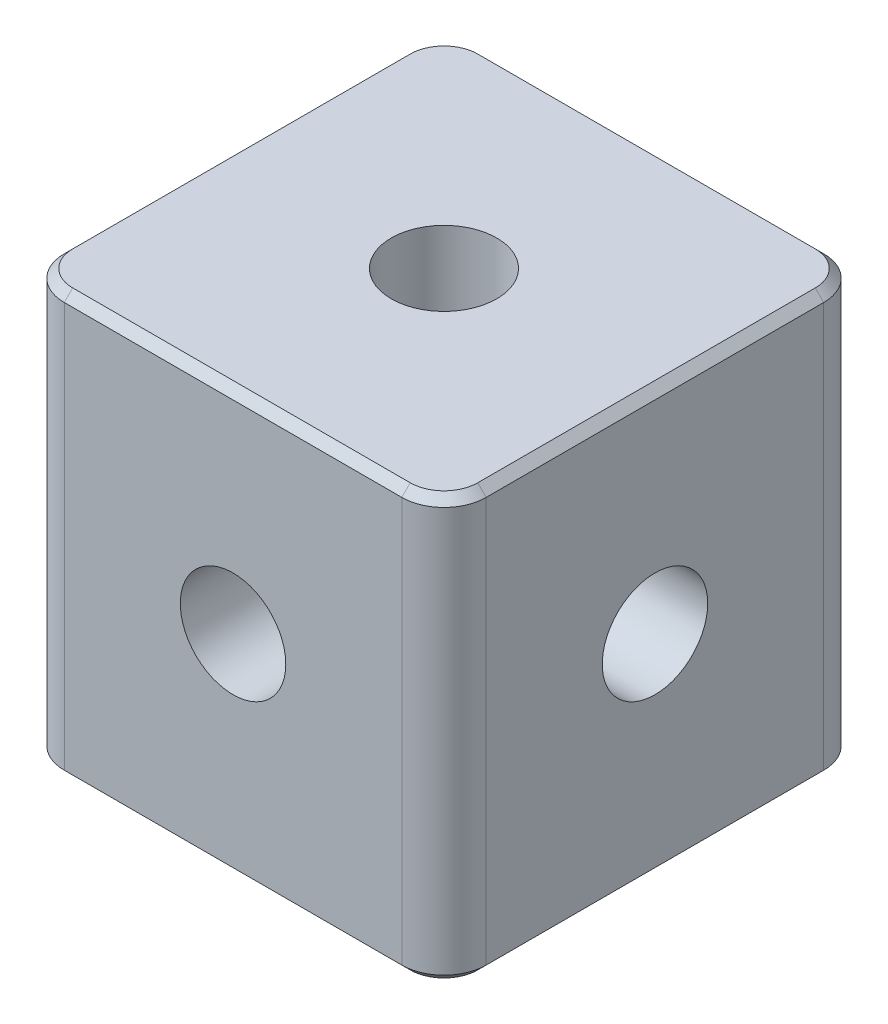
ISO-10303-21;
HEADER;
FILE_DESCRIPTION(('STEP AP214'),'2;1');
FILE_NAME('part.step','',(''),(''),'','','');
FILE_SCHEMA(('AUTOMOTIVE_DESIGN { 1 0 10303 214 1 1 1 1 }'));
ENDSEC;
DATA;
#1=APPLICATION_CONTEXT('core data for automotive mechanical design processes');
#2=APPLICATION_PROTOCOL_DEFINITION('international standard','automotive_design',2000,#1);
#3=PRODUCT_CONTEXT('',#1,'mechanical');
#4=PRODUCT('Part','Part','',(#3));
#5=PRODUCT_RELATED_PRODUCT_CATEGORY('part','',(#4));
#6=PRODUCT_DEFINITION_FORMATION('','',#4);
#7=PRODUCT_DEFINITION_CONTEXT('part definition',#1,'design');
#8=PRODUCT_DEFINITION('design','',#6,#7);
#9=PRODUCT_DEFINITION_SHAPE('','',#8);
#10=(LENGTH_UNIT() NAMED_UNIT(*) SI_UNIT(.MILLI.,.METRE.));
#11=(NAMED_UNIT(*) PLANE_ANGLE_UNIT() SI_UNIT($,.RADIAN.));
#12=(NAMED_UNIT(*) SI_UNIT($,.STERADIAN.) SOLID_ANGLE_UNIT());
#13=UNCERTAINTY_MEASURE_WITH_UNIT(LENGTH_MEASURE(1.E-05),#10,'distance_accuracy_value','');
#14=(GEOMETRIC_REPRESENTATION_CONTEXT(3) GLOBAL_UNCERTAINTY_ASSIGNED_CONTEXT((#13)) GLOBAL_UNIT_ASSIGNED_CONTEXT((#10,
#11,#12)) REPRESENTATION_CONTEXT('',''));
#15=CARTESIAN_POINT('',(0.,0.,0.));
#16=DIRECTION('',(0.,0.,1.));
#17=DIRECTION('',(1.,0.,0.));
#18=AXIS2_PLACEMENT_3D('',#15,#16,#17);
#19=CARTESIAN_POINT('',(0.,5.,0.));
#20=DIRECTION('',(0.,1.,0.));
#21=DIRECTION('',(0.,0.,1.));
#22=AXIS2_PLACEMENT_3D('',#19,#20,#21);
#23=CYLINDRICAL_SURFACE('',#22,1.25);
#24=CARTESIAN_POINT('',(0.,5.,0.));
#25=DIRECTION('',(0.,1.,0.));
#26=DIRECTION('',(0.,0.,1.));
#27=AXIS2_PLACEMENT_3D('',#24,#25,#26);
#28=CIRCLE('',#27,1.25);
#29=CARTESIAN_POINT('',(0.,5.,1.25));
#30=VERTEX_POINT('',#29);
#31=EDGE_CURVE('E418',#30,#30,#28,.T.);
#32=ORIENTED_EDGE('',*,*,#31,.T.);
#33=EDGE_LOOP('',(#32));
#34=FACE_BOUND('',#33,.T.);
#35=CARTESIAN_POINT('',(0.,0.,0.));
#36=DIRECTION('',(0.,0.707106781186547,-0.707106781186547));
#37=DIRECTION('',(0.,0.707106781186547,0.707106781186547));
#38=AXIS2_PLACEMENT_3D('',#35,#36,#37);
#39=ELLIPSE('',#38,1.76776695296636,1.25);
#40=CARTESIAN_POINT('',(0.883883476483181,0.883883476483181,0.883883476483181));
#41=VERTEX_POINT('',#40);
#42=CARTESIAN_POINT('',(-0.883883476483181,0.883883476483181,0.883883476483181));
#43=VERTEX_POINT('',#42);
#44=EDGE_CURVE('E195',#41,#43,#39,.F.);
#45=ORIENTED_EDGE('',*,*,#44,.T.);
#46=CARTESIAN_POINT('',(0.,0.,0.));
#47=DIRECTION('',(0.707106781186547,0.707106781186547,0.));
#48=DIRECTION('',(-0.707106781186547,0.707106781186547,0.));
#49=AXIS2_PLACEMENT_3D('',#46,#47,#48);
#50=ELLIPSE('',#49,1.76776695296636,1.25);
#51=CARTESIAN_POINT('',(-0.88388347648318,0.88388347648318,-0.88388347648318));
#52=VERTEX_POINT('',#51);
#53=EDGE_CURVE('E179',#43,#52,#50,.F.);
#54=ORIENTED_EDGE('',*,*,#53,.T.);
#55=CARTESIAN_POINT('',(0.,0.,0.));
#56=DIRECTION('',(0.,0.707106781186547,0.707106781186547));
#57=DIRECTION('',(0.,0.707106781186547,-0.707106781186547));
#58=AXIS2_PLACEMENT_3D('',#55,#56,#57);
#59=ELLIPSE('',#58,1.76776695296636,1.25);
#60=CARTESIAN_POINT('',(0.883883476483181,0.883883476483181,-0.883883476483181));
#61=VERTEX_POINT('',#60);
#62=EDGE_CURVE('E188',#52,#61,#59,.F.);
#63=ORIENTED_EDGE('',*,*,#62,.T.);
#64=CARTESIAN_POINT('',(0.,0.,0.));
#65=DIRECTION('',(-0.707106781186547,0.707106781186547,0.));
#66=DIRECTION('',(0.707106781186547,0.707106781186547,0.));
#67=AXIS2_PLACEMENT_3D('',#64,#65,#66);
#68=ELLIPSE('',#67,1.76776695296636,1.25);
#69=EDGE_CURVE('E439',#61,#41,#68,.F.);
#70=ORIENTED_EDGE('',*,*,#69,.T.);
#71=EDGE_LOOP('',(#45,#54,#63,#70));
#72=FACE_BOUND('',#71,.T.);
#73=ADVANCED_FACE('F36',(#34,#72),#23,.F.);
#74=CARTESIAN_POINT('',(5.,5.,5.));
#75=DIRECTION('',(-1.,0.,0.));
#76=DIRECTION('',(0.,0.,1.));
#77=AXIS2_PLACEMENT_3D('',#74,#75,#76);
#78=PLANE('',#77);
#79=CARTESIAN_POINT('',(5.,0.,0.));
#80=DIRECTION('',(1.,0.,0.));
#81=DIRECTION('',(0.,0.,-1.));
#82=AXIS2_PLACEMENT_3D('',#79,#80,#81);
#83=CIRCLE('',#82,1.24999999999999);
#84=CARTESIAN_POINT('',(5.,0.,-1.24999999999999));
#85=VERTEX_POINT('',#84);
#86=EDGE_CURVE('E317',#85,#85,#83,.T.);
#87=ORIENTED_EDGE('',*,*,#86,.F.);
#88=EDGE_LOOP('',(#87));
#89=FACE_BOUND('',#88,.T.);
#90=DIRECTION('',(0.,-1.,0.));
#91=VECTOR('',#90,1.);
#92=CARTESIAN_POINT('',(5.,5.,4.));
#93=LINE('',#92,#91);
#94=CARTESIAN_POINT('',(5.,4.8,4.));
#95=VERTEX_POINT('',#94);
#96=CARTESIAN_POINT('',(5.,-4.8,4.));
#97=VERTEX_POINT('',#96);
#98=EDGE_CURVE('E214',#95,#97,#93,.T.);
#99=ORIENTED_EDGE('',*,*,#98,.T.);
#100=DIRECTION('',(0.,0.,-1.));
#101=VECTOR('',#100,1.);
#102=CARTESIAN_POINT('',(5.,-4.8,-4.));
#103=LINE('',#102,#101);
#104=CARTESIAN_POINT('',(5.,-4.8,-4.));
#105=VERTEX_POINT('',#104);
#106=EDGE_CURVE('E235',#97,#105,#103,.T.);
#107=ORIENTED_EDGE('',*,*,#106,.T.);
#108=DIRECTION('',(0.,-1.,0.));
#109=VECTOR('',#108,1.);
#110=CARTESIAN_POINT('',(5.,5.,-4.));
#111=LINE('',#110,#109);
#112=CARTESIAN_POINT('',(5.,4.8,-4.));
#113=VERTEX_POINT('',#112);
#114=EDGE_CURVE('E217',#105,#113,#111,.F.);
#115=ORIENTED_EDGE('',*,*,#114,.T.);
#116=DIRECTION('',(0.,0.,1.));
#117=VECTOR('',#116,1.);
#118=CARTESIAN_POINT('',(5.,4.8,5.));
#119=LINE('',#118,#117);
#120=EDGE_CURVE('E232',#113,#95,#119,.T.);
#121=ORIENTED_EDGE('',*,*,#120,.T.);
#122=EDGE_LOOP('',(#99,#107,#115,#121));
#123=FACE_BOUND('',#122,.T.);
#124=ADVANCED_FACE('F403',(#89,#123),#78,.F.);
#125=CARTESIAN_POINT('',(-5.,5.,-5.));
#126=DIRECTION('',(0.,0.,1.));
#127=DIRECTION('',(1.,0.,0.));
#128=AXIS2_PLACEMENT_3D('',#125,#126,#127);
#129=PLANE('',#128);
#130=CARTESIAN_POINT('',(0.,0.,-5.));
#131=DIRECTION('',(0.,0.,1.));
#132=DIRECTION('',(1.,0.,0.));
#133=AXIS2_PLACEMENT_3D('',#130,#131,#132);
#134=CIRCLE('',#133,1.25);
#135=CARTESIAN_POINT('',(1.25,0.,-5.));
#136=VERTEX_POINT('',#135);
#137=EDGE_CURVE('E421',#136,#136,#134,.T.);
#138=ORIENTED_EDGE('',*,*,#137,.T.);
#139=EDGE_LOOP('',(#138));
#140=FACE_BOUND('',#139,.T.);
#141=DIRECTION('',(0.,-1.,0.));
#142=VECTOR('',#141,1.);
#143=CARTESIAN_POINT('',(4.,5.,-5.));
#144=LINE('',#143,#142);
#145=CARTESIAN_POINT('',(4.,4.8,-5.));
#146=VERTEX_POINT('',#145);
#147=CARTESIAN_POINT('',(4.,-4.8,-5.));
#148=VERTEX_POINT('',#147);
#149=EDGE_CURVE('E211',#146,#148,#144,.T.);
#150=ORIENTED_EDGE('',*,*,#149,.T.);
#151=DIRECTION('',(-1.,0.,0.));
#152=VECTOR('',#151,1.);
#153=CARTESIAN_POINT('',(-4.,-4.8,-5.));
#154=LINE('',#153,#152);
#155=CARTESIAN_POINT('',(-4.,-4.8,-5.));
#156=VERTEX_POINT('',#155);
#157=EDGE_CURVE('E265',#148,#156,#154,.T.);
#158=ORIENTED_EDGE('',*,*,#157,.T.);
#159=DIRECTION('',(0.,-1.,0.));
#160=VECTOR('',#159,1.);
#161=CARTESIAN_POINT('',(-4.,5.,-5.));
#162=LINE('',#161,#160);
#163=CARTESIAN_POINT('',(-4.,4.8,-5.));
#164=VERTEX_POINT('',#163);
#165=EDGE_CURVE('E208',#156,#164,#162,.F.);
#166=ORIENTED_EDGE('',*,*,#165,.T.);
#167=DIRECTION('',(1.,0.,0.));
#168=VECTOR('',#167,1.);
#169=CARTESIAN_POINT('',(-5.,4.8,-5.));
#170=LINE('',#169,#168);
#171=EDGE_CURVE('E263',#164,#146,#170,.T.);
#172=ORIENTED_EDGE('',*,*,#171,.T.);
#173=EDGE_LOOP('',(#150,#158,#166,#172));
#174=FACE_BOUND('',#173,.T.);
#175=ADVANCED_FACE('F455',(#140,#174),#129,.F.);
#176=CARTESIAN_POINT('',(-5.,5.,5.));
#177=DIRECTION('',(1.,0.,0.));
#178=DIRECTION('',(0.,0.,-1.));
#179=AXIS2_PLACEMENT_3D('',#176,#177,#178);
#180=PLANE('',#179);
#181=CARTESIAN_POINT('',(-5.,0.,0.));
#182=DIRECTION('',(1.,0.,0.));
#183=DIRECTION('',(0.,0.,-1.));
#184=AXIS2_PLACEMENT_3D('',#181,#182,#183);
#185=CIRCLE('',#184,1.25);
#186=CARTESIAN_POINT('',(-5.,0.,-1.25));
#187=VERTEX_POINT('',#186);
#188=EDGE_CURVE('E743',#187,#187,#185,.T.);
#189=ORIENTED_EDGE('',*,*,#188,.T.);
#190=EDGE_LOOP('',(#189));
#191=FACE_BOUND('',#190,.T.);
#192=DIRECTION('',(0.,-1.,0.));
#193=VECTOR('',#192,1.);
#194=CARTESIAN_POINT('',(-5.,5.,-4.));
#195=LINE('',#194,#193);
#196=CARTESIAN_POINT('',(-5.,4.8,-4.));
#197=VERTEX_POINT('',#196);
#198=CARTESIAN_POINT('',(-5.,-4.8,-4.));
#199=VERTEX_POINT('',#198);
#200=EDGE_CURVE('E226',#197,#199,#195,.T.);
#201=ORIENTED_EDGE('',*,*,#200,.T.);
#202=DIRECTION('',(0.,0.,1.));
#203=VECTOR('',#202,1.);
#204=CARTESIAN_POINT('',(-5.,-4.8,4.));
#205=LINE('',#204,#203);
#206=CARTESIAN_POINT('',(-5.,-4.8,4.));
#207=VERTEX_POINT('',#206);
#208=EDGE_CURVE('E281',#199,#207,#205,.T.);
#209=ORIENTED_EDGE('',*,*,#208,.T.);
#210=DIRECTION('',(0.,-1.,0.));
#211=VECTOR('',#210,1.);
#212=CARTESIAN_POINT('',(-5.,5.,4.));
#213=LINE('',#212,#211);
#214=CARTESIAN_POINT('',(-5.,4.8,4.));
#215=VERTEX_POINT('',#214);
#216=EDGE_CURVE('E229',#207,#215,#213,.F.);
#217=ORIENTED_EDGE('',*,*,#216,.T.);
#218=DIRECTION('',(0.,0.,-1.));
#219=VECTOR('',#218,1.);
#220=CARTESIAN_POINT('',(-5.,4.8,5.));
#221=LINE('',#220,#219);
#222=EDGE_CURVE('E279',#215,#197,#221,.T.);
#223=ORIENTED_EDGE('',*,*,#222,.T.);
#224=EDGE_LOOP('',(#201,#209,#217,#223));
#225=FACE_BOUND('',#224,.T.);
#226=ADVANCED_FACE('F350',(#191,#225),#180,.F.);
#227=CARTESIAN_POINT('',(-5.,5.,5.));
#228=DIRECTION('',(0.,0.,-1.));
#229=DIRECTION('',(-1.,0.,0.));
#230=AXIS2_PLACEMENT_3D('',#227,#228,#229);
#231=PLANE('',#230);
#232=CARTESIAN_POINT('',(0.,0.,5.));
#233=DIRECTION('',(0.,0.,1.));
#234=DIRECTION('',(1.,0.,0.));
#235=AXIS2_PLACEMENT_3D('',#232,#233,#234);
#236=CIRCLE('',#235,1.24999999999999);
#237=CARTESIAN_POINT('',(1.24999999999999,0.,5.));
#238=VERTEX_POINT('',#237);
#239=EDGE_CURVE('E426',#238,#238,#236,.T.);
#240=ORIENTED_EDGE('',*,*,#239,.F.);
#241=EDGE_LOOP('',(#240));
#242=FACE_BOUND('',#241,.T.);
#243=DIRECTION('',(0.,-1.,0.));
#244=VECTOR('',#243,1.);
#245=CARTESIAN_POINT('',(-4.,5.,5.));
#246=LINE('',#245,#244);
#247=CARTESIAN_POINT('',(-4.,4.8,5.));
#248=VERTEX_POINT('',#247);
#249=CARTESIAN_POINT('',(-4.,-4.8,5.));
#250=VERTEX_POINT('',#249);
#251=EDGE_CURVE('E220',#248,#250,#246,.T.);
#252=ORIENTED_EDGE('',*,*,#251,.T.);
#253=DIRECTION('',(1.,0.,0.));
#254=VECTOR('',#253,1.);
#255=CARTESIAN_POINT('',(4.,-4.8,5.));
#256=LINE('',#255,#254);
#257=CARTESIAN_POINT('',(4.,-4.8,5.));
#258=VERTEX_POINT('',#257);
#259=EDGE_CURVE('E269',#250,#258,#256,.T.);
#260=ORIENTED_EDGE('',*,*,#259,.T.);
#261=DIRECTION('',(0.,-1.,0.));
#262=VECTOR('',#261,1.);
#263=CARTESIAN_POINT('',(4.,5.,5.));
#264=LINE('',#263,#262);
#265=CARTESIAN_POINT('',(4.,4.8,5.));
#266=VERTEX_POINT('',#265);
#267=EDGE_CURVE('E223',#258,#266,#264,.F.);
#268=ORIENTED_EDGE('',*,*,#267,.T.);
#269=DIRECTION('',(-1.,0.,0.));
#270=VECTOR('',#269,1.);
#271=CARTESIAN_POINT('',(-5.,4.8,5.));
#272=LINE('',#271,#270);
#273=EDGE_CURVE('E267',#266,#248,#272,.T.);
#274=ORIENTED_EDGE('',*,*,#273,.T.);
#275=EDGE_LOOP('',(#252,#260,#268,#274));
#276=FACE_BOUND('',#275,.T.);
#277=ADVANCED_FACE('F383',(#242,#276),#231,.F.);
#278=CARTESIAN_POINT('',(0.,5.,0.));
#279=DIRECTION('',(0.,-1.,0.));
#280=DIRECTION('',(0.,0.,-1.));
#281=AXIS2_PLACEMENT_3D('',#278,#279,#280);
#282=PLANE('',#281);
#283=CARTESIAN_POINT('',(4.,5.,4.));
#284=DIRECTION('',(0.,-1.,0.));
#285=DIRECTION('',(0.,0.,-1.));
#286=AXIS2_PLACEMENT_3D('',#283,#284,#285);
#287=CIRCLE('',#286,0.800000000000001);
#288=CARTESIAN_POINT('',(4.,5.,4.8));
#289=VERTEX_POINT('',#288);
#290=CARTESIAN_POINT('',(4.8,5.,4.));
#291=VERTEX_POINT('',#290);
#292=EDGE_CURVE('E60',#289,#291,#287,.F.);
#293=ORIENTED_EDGE('',*,*,#292,.T.);
#294=DIRECTION('',(0.,0.,-1.));
#295=VECTOR('',#294,1.);
#296=CARTESIAN_POINT('',(4.8,5.,0.));
#297=LINE('',#296,#295);
#298=CARTESIAN_POINT('',(4.8,5.,-4.));
#299=VERTEX_POINT('',#298);
#300=EDGE_CURVE('E11',#291,#299,#297,.T.);
#301=ORIENTED_EDGE('',*,*,#300,.T.);
#302=CARTESIAN_POINT('',(4.,5.,-4.));
#303=DIRECTION('',(0.,-1.,0.));
#304=DIRECTION('',(0.,0.,-1.));
#305=AXIS2_PLACEMENT_3D('',#302,#303,#304);
#306=CIRCLE('',#305,0.800000000000001);
#307=CARTESIAN_POINT('',(4.,5.,-4.8));
#308=VERTEX_POINT('',#307);
#309=EDGE_CURVE('E45',#299,#308,#306,.F.);
#310=ORIENTED_EDGE('',*,*,#309,.T.);
#311=DIRECTION('',(-1.,0.,0.));
#312=VECTOR('',#311,1.);
#313=CARTESIAN_POINT('',(0.,5.,-4.8));
#314=LINE('',#313,#312);
#315=CARTESIAN_POINT('',(-4.,5.,-4.8));
#316=VERTEX_POINT('',#315);
#317=EDGE_CURVE('E291',#308,#316,#314,.T.);
#318=ORIENTED_EDGE('',*,*,#317,.T.);
#319=CARTESIAN_POINT('',(-4.,5.,-4.));
#320=DIRECTION('',(0.,-1.,0.));
#321=DIRECTION('',(0.,0.,-1.));
#322=AXIS2_PLACEMENT_3D('',#319,#320,#321);
#323=CIRCLE('',#322,0.800000000000001);
#324=CARTESIAN_POINT('',(-4.8,5.,-4.));
#325=VERTEX_POINT('',#324);
#326=EDGE_CURVE('E287',#316,#325,#323,.F.);
#327=ORIENTED_EDGE('',*,*,#326,.T.);
#328=DIRECTION('',(0.,0.,1.));
#329=VECTOR('',#328,1.);
#330=CARTESIAN_POINT('',(-4.8,5.,0.));
#331=LINE('',#330,#329);
#332=CARTESIAN_POINT('',(-4.8,5.,4.));
#333=VERTEX_POINT('',#332);
#334=EDGE_CURVE('E283',#325,#333,#331,.T.);
#335=ORIENTED_EDGE('',*,*,#334,.T.);
#336=CARTESIAN_POINT('',(-4.,5.,4.));
#337=DIRECTION('',(0.,-1.,0.));
#338=DIRECTION('',(0.,0.,-1.));
#339=AXIS2_PLACEMENT_3D('',#336,#337,#338);
#340=CIRCLE('',#339,0.800000000000001);
#341=CARTESIAN_POINT('',(-4.,5.,4.8));
#342=VERTEX_POINT('',#341);
#343=EDGE_CURVE('E285',#333,#342,#340,.F.);
#344=ORIENTED_EDGE('',*,*,#343,.T.);
#345=DIRECTION('',(1.,0.,0.));
#346=VECTOR('',#345,1.);
#347=CARTESIAN_POINT('',(0.,5.,4.8));
#348=LINE('',#347,#346);
#349=EDGE_CURVE('E289',#342,#289,#348,.T.);
#350=ORIENTED_EDGE('',*,*,#349,.T.);
#351=EDGE_LOOP('',(#293,#301,#310,#318,#327,#335,#344,#350));
#352=FACE_BOUND('',#351,.T.);
#353=ORIENTED_EDGE('',*,*,#31,.F.);
#354=EDGE_LOOP('',(#353));
#355=FACE_BOUND('',#354,.T.);
#356=ADVANCED_FACE('F412',(#352,#355),#282,.F.);
#357=CARTESIAN_POINT('',(0.,-5.,0.));
#358=DIRECTION('',(0.,-1.,0.));
#359=DIRECTION('',(0.,0.,-1.));
#360=AXIS2_PLACEMENT_3D('',#357,#358,#359);
#361=PLANE('',#360);
#362=CARTESIAN_POINT('',(4.,-5.,-4.));
#363=DIRECTION('',(0.,-1.,0.));
#364=DIRECTION('',(0.,0.,-1.));
#365=AXIS2_PLACEMENT_3D('',#362,#363,#364);
#366=CIRCLE('',#365,0.800000000000001);
#367=CARTESIAN_POINT('',(4.,-5.,-4.8));
#368=VERTEX_POINT('',#367);
#369=CARTESIAN_POINT('',(4.8,-5.,-4.));
#370=VERTEX_POINT('',#369);
#371=EDGE_CURVE('E250',#368,#370,#366,.T.);
#372=ORIENTED_EDGE('',*,*,#371,.T.);
#373=DIRECTION('',(0.,0.,1.));
#374=VECTOR('',#373,1.);
#375=CARTESIAN_POINT('',(4.8,-5.,4.));
#376=LINE('',#375,#374);
#377=CARTESIAN_POINT('',(4.8,-5.,4.));
#378=VERTEX_POINT('',#377);
#379=EDGE_CURVE('E252',#370,#378,#376,.T.);
#380=ORIENTED_EDGE('',*,*,#379,.T.);
#381=CARTESIAN_POINT('',(4.,-5.,4.));
#382=DIRECTION('',(0.,-1.,0.));
#383=DIRECTION('',(0.,0.,-1.));
#384=AXIS2_PLACEMENT_3D('',#381,#382,#383);
#385=CIRCLE('',#384,0.800000000000001);
#386=CARTESIAN_POINT('',(4.,-5.,4.8));
#387=VERTEX_POINT('',#386);
#388=EDGE_CURVE('E248',#378,#387,#385,.T.);
#389=ORIENTED_EDGE('',*,*,#388,.T.);
#390=DIRECTION('',(-1.,0.,0.));
#391=VECTOR('',#390,1.);
#392=CARTESIAN_POINT('',(-4.,-5.,4.8));
#393=LINE('',#392,#391);
#394=CARTESIAN_POINT('',(-4.,-5.,4.8));
#395=VERTEX_POINT('',#394);
#396=EDGE_CURVE('E244',#387,#395,#393,.T.);
#397=ORIENTED_EDGE('',*,*,#396,.T.);
#398=CARTESIAN_POINT('',(-4.,-5.,4.));
#399=DIRECTION('',(0.,-1.,0.));
#400=DIRECTION('',(0.,0.,-1.));
#401=AXIS2_PLACEMENT_3D('',#398,#399,#400);
#402=CIRCLE('',#401,0.800000000000001);
#403=CARTESIAN_POINT('',(-4.8,-5.,4.));
#404=VERTEX_POINT('',#403);
#405=EDGE_CURVE('E240',#395,#404,#402,.T.);
#406=ORIENTED_EDGE('',*,*,#405,.T.);
#407=DIRECTION('',(0.,0.,-1.));
#408=VECTOR('',#407,1.);
#409=CARTESIAN_POINT('',(-4.8,-5.,-4.));
#410=LINE('',#409,#408);
#411=CARTESIAN_POINT('',(-4.8,-5.,-4.));
#412=VERTEX_POINT('',#411);
#413=EDGE_CURVE('E238',#404,#412,#410,.T.);
#414=ORIENTED_EDGE('',*,*,#413,.T.);
#415=CARTESIAN_POINT('',(-4.,-5.,-4.));
#416=DIRECTION('',(0.,-1.,0.));
#417=DIRECTION('',(0.,0.,-1.));
#418=AXIS2_PLACEMENT_3D('',#415,#416,#417);
#419=CIRCLE('',#418,0.800000000000001);
#420=CARTESIAN_POINT('',(-4.,-5.,-4.8));
#421=VERTEX_POINT('',#420);
#422=EDGE_CURVE('E242',#412,#421,#419,.T.);
#423=ORIENTED_EDGE('',*,*,#422,.T.);
#424=DIRECTION('',(1.,0.,0.));
#425=VECTOR('',#424,1.);
#426=CARTESIAN_POINT('',(4.,-5.,-4.8));
#427=LINE('',#426,#425);
#428=EDGE_CURVE('E246',#421,#368,#427,.T.);
#429=ORIENTED_EDGE('',*,*,#428,.T.);
#430=EDGE_LOOP('',(#372,#380,#389,#397,#406,#414,#423,#429));
#431=FACE_BOUND('',#430,.T.);
#432=CARTESIAN_POINT('',(0.,-5.,0.));
#433=DIRECTION('',(0.,1.,0.));
#434=DIRECTION('',(0.,0.,1.));
#435=AXIS2_PLACEMENT_3D('',#432,#433,#434);
#436=CIRCLE('',#435,1.25);
#437=CARTESIAN_POINT('',(0.,-5.,1.25));
#438=VERTEX_POINT('',#437);
#439=EDGE_CURVE('E420',#438,#438,#436,.T.);
#440=ORIENTED_EDGE('',*,*,#439,.T.);
#441=EDGE_LOOP('',(#440));
#442=FACE_BOUND('',#441,.T.);
#443=ADVANCED_FACE('F369',(#431,#442),#361,.T.);
#444=CARTESIAN_POINT('',(0.,0.,0.));
#445=DIRECTION('',(0.,0.707106781186547,0.707106781186547));
#446=DIRECTION('',(0.,0.707106781186547,-0.707106781186547));
#447=AXIS2_PLACEMENT_3D('',#444,#445,#446);
#448=ELLIPSE('',#447,1.76776695296636,1.25);
#449=CARTESIAN_POINT('',(-0.883883476483181,-0.883883476483181,0.883883476483181));
#450=VERTEX_POINT('',#449);
#451=CARTESIAN_POINT('',(0.883883476483181,-0.883883476483181,0.883883476483181));
#452=VERTEX_POINT('',#451);
#453=EDGE_CURVE('E200',#450,#452,#448,.T.);
#454=ORIENTED_EDGE('',*,*,#453,.T.);
#455=CARTESIAN_POINT('',(0.,0.,0.));
#456=DIRECTION('',(0.707106781186547,0.707106781186547,0.));
#457=DIRECTION('',(-0.707106781186547,0.707106781186547,0.));
#458=AXIS2_PLACEMENT_3D('',#455,#456,#457);
#459=ELLIPSE('',#458,1.76776695296636,1.25);
#460=CARTESIAN_POINT('',(0.88388347648318,-0.88388347648318,-0.88388347648318));
#461=VERTEX_POINT('',#460);
#462=EDGE_CURVE('E435',#452,#461,#459,.T.);
#463=ORIENTED_EDGE('',*,*,#462,.T.);
#464=CARTESIAN_POINT('',(0.,0.,0.));
#465=DIRECTION('',(0.,0.707106781186547,-0.707106781186547));
#466=DIRECTION('',(0.,0.707106781186547,0.707106781186547));
#467=AXIS2_PLACEMENT_3D('',#464,#465,#466);
#468=ELLIPSE('',#467,1.76776695296636,1.25);
#469=CARTESIAN_POINT('',(-0.88388347648318,-0.88388347648318,-0.88388347648318));
#470=VERTEX_POINT('',#469);
#471=EDGE_CURVE('E203',#461,#470,#468,.T.);
#472=ORIENTED_EDGE('',*,*,#471,.T.);
#473=CARTESIAN_POINT('',(0.,0.,0.));
#474=DIRECTION('',(-0.707106781186547,0.707106781186547,0.));
#475=DIRECTION('',(0.707106781186547,0.707106781186547,0.));
#476=AXIS2_PLACEMENT_3D('',#473,#474,#475);
#477=ELLIPSE('',#476,1.76776695296636,1.25);
#478=EDGE_CURVE('E182',#470,#450,#477,.T.);
#479=ORIENTED_EDGE('',*,*,#478,.T.);
#480=EDGE_LOOP('',(#454,#463,#472,#479));
#481=FACE_BOUND('',#480,.T.);
#482=ORIENTED_EDGE('',*,*,#439,.F.);
#483=EDGE_LOOP('',(#482));
#484=FACE_BOUND('',#483,.T.);
#485=ADVANCED_FACE('F432',(#481,#484),#23,.F.);
#486=CARTESIAN_POINT('',(0.,0.,5.));
#487=DIRECTION('',(0.,0.,1.));
#488=DIRECTION('',(1.,0.,0.));
#489=AXIS2_PLACEMENT_3D('',#486,#487,#488);
#490=CYLINDRICAL_SURFACE('',#489,1.24999999999999);
#491=ORIENTED_EDGE('',*,*,#239,.T.);
#492=EDGE_LOOP('',(#491));
#493=FACE_BOUND('',#492,.T.);
#494=ORIENTED_EDGE('',*,*,#453,.F.);
#495=CARTESIAN_POINT('',(0.,0.,0.));
#496=DIRECTION('',(0.707106781186547,0.,0.707106781186547));
#497=DIRECTION('',(-0.707106781186547,0.,0.707106781186547));
#498=AXIS2_PLACEMENT_3D('',#495,#496,#497);
#499=ELLIPSE('',#498,1.76776695296636,1.24999999999999);
#500=EDGE_CURVE('E196',#450,#43,#499,.F.);
#501=ORIENTED_EDGE('',*,*,#500,.T.);
#502=ORIENTED_EDGE('',*,*,#44,.F.);
#503=CARTESIAN_POINT('',(0.,0.,0.));
#504=DIRECTION('',(-0.707106781186547,0.,0.707106781186547));
#505=DIRECTION('',(0.707106781186547,0.,0.707106781186547));
#506=AXIS2_PLACEMENT_3D('',#503,#504,#505);
#507=ELLIPSE('',#506,1.76776695296636,1.24999999999999);
#508=EDGE_CURVE('E438',#41,#452,#507,.F.);
#509=ORIENTED_EDGE('',*,*,#508,.T.);
#510=EDGE_LOOP('',(#494,#501,#502,#509));
#511=FACE_BOUND('',#510,.T.);
#512=ADVANCED_FACE('F447',(#493,#511),#490,.F.);
#513=ORIENTED_EDGE('',*,*,#137,.F.);
#514=EDGE_LOOP('',(#513));
#515=FACE_BOUND('',#514,.T.);
#516=ORIENTED_EDGE('',*,*,#471,.F.);
#517=CARTESIAN_POINT('',(0.,0.,0.));
#518=DIRECTION('',(0.707106781186547,0.,0.707106781186547));
#519=DIRECTION('',(-0.707106781186547,0.,0.707106781186547));
#520=AXIS2_PLACEMENT_3D('',#517,#518,#519);
#521=ELLIPSE('',#520,1.76776695296636,1.24999999999999);
#522=EDGE_CURVE('E187',#461,#61,#521,.T.);
#523=ORIENTED_EDGE('',*,*,#522,.T.);
#524=ORIENTED_EDGE('',*,*,#62,.F.);
#525=CARTESIAN_POINT('',(0.,0.,0.));
#526=DIRECTION('',(-0.707106781186547,0.,0.707106781186547));
#527=DIRECTION('',(0.707106781186547,0.,0.707106781186547));
#528=AXIS2_PLACEMENT_3D('',#525,#526,#527);
#529=ELLIPSE('',#528,1.76776695296636,1.24999999999999);
#530=EDGE_CURVE('E176',#52,#470,#529,.T.);
#531=ORIENTED_EDGE('',*,*,#530,.T.);
#532=EDGE_LOOP('',(#516,#523,#524,#531));
#533=FACE_BOUND('',#532,.T.);
#534=ADVANCED_FACE('F199',(#515,#533),#490,.F.);
#535=CARTESIAN_POINT('',(5.,0.,0.));
#536=DIRECTION('',(1.,0.,0.));
#537=DIRECTION('',(0.,0.,-1.));
#538=AXIS2_PLACEMENT_3D('',#535,#536,#537);
#539=CYLINDRICAL_SURFACE('',#538,1.24999999999999);
#540=ORIENTED_EDGE('',*,*,#188,.F.);
#541=EDGE_LOOP('',(#540));
#542=FACE_BOUND('',#541,.T.);
#543=ORIENTED_EDGE('',*,*,#478,.F.);
#544=ORIENTED_EDGE('',*,*,#530,.F.);
#545=ORIENTED_EDGE('',*,*,#53,.F.);
#546=ORIENTED_EDGE('',*,*,#500,.F.);
#547=EDGE_LOOP('',(#543,#544,#545,#546));
#548=FACE_BOUND('',#547,.T.);
#549=ADVANCED_FACE('F178',(#542,#548),#539,.F.);
#550=ORIENTED_EDGE('',*,*,#86,.T.);
#551=EDGE_LOOP('',(#550));
#552=FACE_BOUND('',#551,.T.);
#553=ORIENTED_EDGE('',*,*,#69,.F.);
#554=ORIENTED_EDGE('',*,*,#522,.F.);
#555=ORIENTED_EDGE('',*,*,#462,.F.);
#556=ORIENTED_EDGE('',*,*,#508,.F.);
#557=EDGE_LOOP('',(#553,#554,#555,#556));
#558=FACE_BOUND('',#557,.T.);
#559=ADVANCED_FACE('F509',(#552,#558),#539,.F.);
#560=CARTESIAN_POINT('',(4.,5.,-4.));
#561=DIRECTION('',(0.,-1.,0.));
#562=DIRECTION('',(0.,0.,-1.));
#563=AXIS2_PLACEMENT_3D('',#560,#561,#562);
#564=CYLINDRICAL_SURFACE('',#563,1.);
#565=ORIENTED_EDGE('',*,*,#114,.F.);
#566=CARTESIAN_POINT('',(4.,-4.8,-4.));
#567=DIRECTION('',(0.,-1.,0.));
#568=DIRECTION('',(0.,0.,-1.));
#569=AXIS2_PLACEMENT_3D('',#566,#567,#568);
#570=CIRCLE('',#569,1.);
#571=EDGE_CURVE('E257',#105,#148,#570,.F.);
#572=ORIENTED_EDGE('',*,*,#571,.T.);
#573=ORIENTED_EDGE('',*,*,#149,.F.);
#574=CARTESIAN_POINT('',(4.,4.8,-4.));
#575=DIRECTION('',(0.,-1.,0.));
#576=DIRECTION('',(0.,0.,-1.));
#577=AXIS2_PLACEMENT_3D('',#574,#575,#576);
#578=CIRCLE('',#577,1.);
#579=EDGE_CURVE('E255',#146,#113,#578,.T.);
#580=ORIENTED_EDGE('',*,*,#579,.T.);
#581=EDGE_LOOP('',(#565,#572,#573,#580));
#582=FACE_BOUND('',#581,.T.);
#583=ADVANCED_FACE('F515',(#582),#564,.T.);
#584=CARTESIAN_POINT('',(4.,5.,4.));
#585=DIRECTION('',(0.,-1.,0.));
#586=DIRECTION('',(0.,0.,-1.));
#587=AXIS2_PLACEMENT_3D('',#584,#585,#586);
#588=CYLINDRICAL_SURFACE('',#587,1.);
#589=ORIENTED_EDGE('',*,*,#267,.F.);
#590=CARTESIAN_POINT('',(4.,-4.8,4.));
#591=DIRECTION('',(0.,-1.,0.));
#592=DIRECTION('',(0.,0.,-1.));
#593=AXIS2_PLACEMENT_3D('',#590,#591,#592);
#594=CIRCLE('',#593,1.);
#595=EDGE_CURVE('E261',#258,#97,#594,.F.);
#596=ORIENTED_EDGE('',*,*,#595,.T.);
#597=ORIENTED_EDGE('',*,*,#98,.F.);
#598=CARTESIAN_POINT('',(4.,4.8,4.));
#599=DIRECTION('',(0.,-1.,0.));
#600=DIRECTION('',(0.,0.,-1.));
#601=AXIS2_PLACEMENT_3D('',#598,#599,#600);
#602=CIRCLE('',#601,1.);
#603=EDGE_CURVE('E259',#95,#266,#602,.T.);
#604=ORIENTED_EDGE('',*,*,#603,.T.);
#605=EDGE_LOOP('',(#589,#596,#597,#604));
#606=FACE_BOUND('',#605,.T.);
#607=ADVANCED_FACE('F401',(#606),#588,.T.);
#608=CARTESIAN_POINT('',(-4.,5.,4.));
#609=DIRECTION('',(0.,-1.,0.));
#610=DIRECTION('',(0.,0.,-1.));
#611=AXIS2_PLACEMENT_3D('',#608,#609,#610);
#612=CYLINDRICAL_SURFACE('',#611,1.);
#613=ORIENTED_EDGE('',*,*,#216,.F.);
#614=CARTESIAN_POINT('',(-4.,-4.8,4.));
#615=DIRECTION('',(0.,-1.,0.));
#616=DIRECTION('',(0.,0.,-1.));
#617=AXIS2_PLACEMENT_3D('',#614,#615,#616);
#618=CIRCLE('',#617,1.);
#619=EDGE_CURVE('E277',#207,#250,#618,.F.);
#620=ORIENTED_EDGE('',*,*,#619,.T.);
#621=ORIENTED_EDGE('',*,*,#251,.F.);
#622=CARTESIAN_POINT('',(-4.,4.8,4.));
#623=DIRECTION('',(0.,-1.,0.));
#624=DIRECTION('',(0.,0.,-1.));
#625=AXIS2_PLACEMENT_3D('',#622,#623,#624);
#626=CIRCLE('',#625,1.);
#627=EDGE_CURVE('E275',#248,#215,#626,.T.);
#628=ORIENTED_EDGE('',*,*,#627,.T.);
#629=EDGE_LOOP('',(#613,#620,#621,#628));
#630=FACE_BOUND('',#629,.T.);
#631=ADVANCED_FACE('F379',(#630),#612,.T.);
#632=CARTESIAN_POINT('',(-4.,5.,-4.));
#633=DIRECTION('',(0.,-1.,0.));
#634=DIRECTION('',(0.,0.,-1.));
#635=AXIS2_PLACEMENT_3D('',#632,#633,#634);
#636=CYLINDRICAL_SURFACE('',#635,1.);
#637=ORIENTED_EDGE('',*,*,#165,.F.);
#638=CARTESIAN_POINT('',(-4.,-4.8,-4.));
#639=DIRECTION('',(0.,-1.,0.));
#640=DIRECTION('',(0.,0.,-1.));
#641=AXIS2_PLACEMENT_3D('',#638,#639,#640);
#642=CIRCLE('',#641,1.);
#643=EDGE_CURVE('E273',#156,#199,#642,.F.);
#644=ORIENTED_EDGE('',*,*,#643,.T.);
#645=ORIENTED_EDGE('',*,*,#200,.F.);
#646=CARTESIAN_POINT('',(-4.,4.8,-4.));
#647=DIRECTION('',(0.,-1.,0.));
#648=DIRECTION('',(0.,0.,-1.));
#649=AXIS2_PLACEMENT_3D('',#646,#647,#648);
#650=CIRCLE('',#649,1.);
#651=EDGE_CURVE('E271',#197,#164,#650,.T.);
#652=ORIENTED_EDGE('',*,*,#651,.T.);
#653=EDGE_LOOP('',(#637,#644,#645,#652));
#654=FACE_BOUND('',#653,.T.);
#655=ADVANCED_FACE('F355',(#654),#636,.T.);
#656=CARTESIAN_POINT('',(-5.,-4.8,5.));
#657=DIRECTION('',(-0.707106781186545,-0.70710678118655,0.));
#658=DIRECTION('',(0.,0.,-1.));
#659=AXIS2_PLACEMENT_3D('',#656,#657,#658);
#660=PLANE('',#659);
#661=DIRECTION('',(-0.707106781186551,0.707106781186544,0.));
#662=VECTOR('',#661,1.);
#663=CARTESIAN_POINT('',(-4.8,-5.,-4.));
#664=LINE('',#663,#662);
#665=EDGE_CURVE('E311',#412,#199,#664,.T.);
#666=ORIENTED_EDGE('',*,*,#665,.F.);
#667=ORIENTED_EDGE('',*,*,#413,.F.);
#668=DIRECTION('',(0.707106781186551,-0.707106781186544,0.));
#669=VECTOR('',#668,1.);
#670=CARTESIAN_POINT('',(-5.,-4.8,4.));
#671=LINE('',#670,#669);
#672=EDGE_CURVE('E314',#207,#404,#671,.T.);
#673=ORIENTED_EDGE('',*,*,#672,.F.);
#674=ORIENTED_EDGE('',*,*,#208,.F.);
#675=EDGE_LOOP('',(#666,#667,#673,#674));
#676=FACE_BOUND('',#675,.T.);
#677=ADVANCED_FACE('F376',(#676),#660,.T.);
#678=CARTESIAN_POINT('',(-4.,-5.,4.));
#679=DIRECTION('',(0.,1.,0.));
#680=DIRECTION('',(0.,0.,1.));
#681=AXIS2_PLACEMENT_3D('',#678,#679,#680);
#682=CONICAL_SURFACE('',#681,0.800000000000001,0.785398163397453);
#683=ORIENTED_EDGE('',*,*,#672,.T.);
#684=ORIENTED_EDGE('',*,*,#405,.F.);
#685=DIRECTION('',(0.,-0.707106781186544,-0.707106781186551));
#686=VECTOR('',#685,1.);
#687=CARTESIAN_POINT('',(-4.,-4.8,5.));
#688=LINE('',#687,#686);
#689=EDGE_CURVE('E308',#250,#395,#688,.T.);
#690=ORIENTED_EDGE('',*,*,#689,.F.);
#691=ORIENTED_EDGE('',*,*,#619,.F.);
#692=EDGE_LOOP('',(#683,#684,#690,#691));
#693=FACE_BOUND('',#692,.T.);
#694=ADVANCED_FACE('F388',(#693),#682,.T.);
#695=CARTESIAN_POINT('',(-4.,-5.,-4.));
#696=DIRECTION('',(0.,1.,0.));
#697=DIRECTION('',(0.,0.,1.));
#698=AXIS2_PLACEMENT_3D('',#695,#696,#697);
#699=CONICAL_SURFACE('',#698,0.800000000000001,0.785398163397453);
#700=ORIENTED_EDGE('',*,*,#665,.T.);
#701=ORIENTED_EDGE('',*,*,#643,.F.);
#702=DIRECTION('',(0.,0.707106781186544,-0.707106781186551));
#703=VECTOR('',#702,1.);
#704=CARTESIAN_POINT('',(-4.,-5.,-4.8));
#705=LINE('',#704,#703);
#706=EDGE_CURVE('E305',#421,#156,#705,.T.);
#707=ORIENTED_EDGE('',*,*,#706,.F.);
#708=ORIENTED_EDGE('',*,*,#422,.F.);
#709=EDGE_LOOP('',(#700,#701,#707,#708));
#710=FACE_BOUND('',#709,.T.);
#711=ADVANCED_FACE('F359',(#710),#699,.T.);
#712=CARTESIAN_POINT('',(-5.,-4.8,5.));
#713=DIRECTION('',(0.,-0.707106781186551,0.707106781186544));
#714=DIRECTION('',(-1.,0.,0.));
#715=AXIS2_PLACEMENT_3D('',#712,#713,#714);
#716=PLANE('',#715);
#717=ORIENTED_EDGE('',*,*,#689,.T.);
#718=ORIENTED_EDGE('',*,*,#396,.F.);
#719=DIRECTION('',(0.,-0.707106781186544,-0.707106781186551));
#720=VECTOR('',#719,1.);
#721=CARTESIAN_POINT('',(4.,-4.8,5.));
#722=LINE('',#721,#720);
#723=EDGE_CURVE('E302',#258,#387,#722,.T.);
#724=ORIENTED_EDGE('',*,*,#723,.F.);
#725=ORIENTED_EDGE('',*,*,#259,.F.);
#726=EDGE_LOOP('',(#717,#718,#724,#725));
#727=FACE_BOUND('',#726,.T.);
#728=ADVANCED_FACE('F392',(#727),#716,.T.);
#729=CARTESIAN_POINT('',(-5.,-4.8,-5.));
#730=DIRECTION('',(0.,-0.707106781186551,-0.707106781186544));
#731=DIRECTION('',(1.,0.,0.));
#732=AXIS2_PLACEMENT_3D('',#729,#730,#731);
#733=PLANE('',#732);
#734=ORIENTED_EDGE('',*,*,#706,.T.);
#735=ORIENTED_EDGE('',*,*,#157,.F.);
#736=DIRECTION('',(0.,0.707106781186544,-0.707106781186551));
#737=VECTOR('',#736,1.);
#738=CARTESIAN_POINT('',(4.,-5.,-4.8));
#739=LINE('',#738,#737);
#740=EDGE_CURVE('E299',#368,#148,#739,.T.);
#741=ORIENTED_EDGE('',*,*,#740,.F.);
#742=ORIENTED_EDGE('',*,*,#428,.F.);
#743=EDGE_LOOP('',(#734,#735,#741,#742));
#744=FACE_BOUND('',#743,.T.);
#745=ADVANCED_FACE('F365',(#744),#733,.T.);
#746=CARTESIAN_POINT('',(4.,-5.,4.));
#747=DIRECTION('',(0.,1.,0.));
#748=DIRECTION('',(0.,0.,1.));
#749=AXIS2_PLACEMENT_3D('',#746,#747,#748);
#750=CONICAL_SURFACE('',#749,0.800000000000001,0.785398163397453);
#751=ORIENTED_EDGE('',*,*,#723,.T.);
#752=ORIENTED_EDGE('',*,*,#388,.F.);
#753=DIRECTION('',(-0.707106781186551,-0.707106781186544,0.));
#754=VECTOR('',#753,1.);
#755=CARTESIAN_POINT('',(5.,-4.8,4.));
#756=LINE('',#755,#754);
#757=EDGE_CURVE('E297',#97,#378,#756,.T.);
#758=ORIENTED_EDGE('',*,*,#757,.F.);
#759=ORIENTED_EDGE('',*,*,#595,.F.);
#760=EDGE_LOOP('',(#751,#752,#758,#759));
#761=FACE_BOUND('',#760,.T.);
#762=ADVANCED_FACE('F397',(#761),#750,.T.);
#763=CARTESIAN_POINT('',(4.,-5.,-4.));
#764=DIRECTION('',(0.,1.,0.));
#765=DIRECTION('',(0.,0.,1.));
#766=AXIS2_PLACEMENT_3D('',#763,#764,#765);
#767=CONICAL_SURFACE('',#766,0.800000000000001,0.785398163397453);
#768=ORIENTED_EDGE('',*,*,#740,.T.);
#769=ORIENTED_EDGE('',*,*,#571,.F.);
#770=DIRECTION('',(0.707106781186551,0.707106781186544,0.));
#771=VECTOR('',#770,1.);
#772=CARTESIAN_POINT('',(4.8,-5.,-4.));
#773=LINE('',#772,#771);
#774=EDGE_CURVE('E295',#370,#105,#773,.T.);
#775=ORIENTED_EDGE('',*,*,#774,.F.);
#776=ORIENTED_EDGE('',*,*,#371,.F.);
#777=EDGE_LOOP('',(#768,#769,#775,#776));
#778=FACE_BOUND('',#777,.T.);
#779=ADVANCED_FACE('F621',(#778),#767,.T.);
#780=CARTESIAN_POINT('',(5.,-4.8,5.));
#781=DIRECTION('',(0.707106781186544,-0.707106781186551,0.));
#782=DIRECTION('',(0.,0.,1.));
#783=AXIS2_PLACEMENT_3D('',#780,#781,#782);
#784=PLANE('',#783);
#785=ORIENTED_EDGE('',*,*,#757,.T.);
#786=ORIENTED_EDGE('',*,*,#379,.F.);
#787=ORIENTED_EDGE('',*,*,#774,.T.);
#788=ORIENTED_EDGE('',*,*,#106,.F.);
#789=EDGE_LOOP('',(#785,#786,#787,#788));
#790=FACE_BOUND('',#789,.T.);
#791=ADVANCED_FACE('F628',(#790),#784,.T.);
#792=CARTESIAN_POINT('',(-4.8,5.,0.));
#793=DIRECTION('',(0.707106781186554,-0.707106781186541,0.));
#794=DIRECTION('',(0.,0.,1.));
#795=AXIS2_PLACEMENT_3D('',#792,#793,#794);
#796=PLANE('',#795);
#797=DIRECTION('',(0.70710678118654,0.707106781186555,0.));
#798=VECTOR('',#797,1.);
#799=CARTESIAN_POINT('',(-5.,4.8,-4.));
#800=LINE('',#799,#798);
#801=EDGE_CURVE('E332',#197,#325,#800,.T.);
#802=ORIENTED_EDGE('',*,*,#801,.F.);
#803=ORIENTED_EDGE('',*,*,#222,.F.);
#804=DIRECTION('',(-0.70710678118654,-0.707106781186555,0.));
#805=VECTOR('',#804,1.);
#806=CARTESIAN_POINT('',(-4.8,5.,4.));
#807=LINE('',#806,#805);
#808=EDGE_CURVE('E40',#333,#215,#807,.T.);
#809=ORIENTED_EDGE('',*,*,#808,.F.);
#810=ORIENTED_EDGE('',*,*,#334,.F.);
#811=EDGE_LOOP('',(#802,#803,#809,#810));
#812=FACE_BOUND('',#811,.T.);
#813=ADVANCED_FACE('F38',(#812),#796,.F.);
#814=CARTESIAN_POINT('',(-4.,5.,4.));
#815=DIRECTION('',(0.,-1.,0.));
#816=DIRECTION('',(0.,0.,-1.));
#817=AXIS2_PLACEMENT_3D('',#814,#815,#816);
#818=CONICAL_SURFACE('',#817,0.800000000000001,0.78539816339744);
#819=ORIENTED_EDGE('',*,*,#808,.T.);
#820=ORIENTED_EDGE('',*,*,#627,.F.);
#821=DIRECTION('',(0.,-0.707106781186554,0.707106781186541));
#822=VECTOR('',#821,1.);
#823=CARTESIAN_POINT('',(-4.,5.,4.8));
#824=LINE('',#823,#822);
#825=EDGE_CURVE('E330',#342,#248,#824,.T.);
#826=ORIENTED_EDGE('',*,*,#825,.F.);
#827=ORIENTED_EDGE('',*,*,#343,.F.);
#828=EDGE_LOOP('',(#819,#820,#826,#827));
#829=FACE_BOUND('',#828,.T.);
#830=ADVANCED_FACE('F343',(#829),#818,.T.);
#831=CARTESIAN_POINT('',(-4.,5.,-4.));
#832=DIRECTION('',(0.,-1.,0.));
#833=DIRECTION('',(0.,0.,-1.));
#834=AXIS2_PLACEMENT_3D('',#831,#832,#833);
#835=CONICAL_SURFACE('',#834,0.800000000000001,0.78539816339744);
#836=ORIENTED_EDGE('',*,*,#801,.T.);
#837=ORIENTED_EDGE('',*,*,#326,.F.);
#838=DIRECTION('',(0.,0.707106781186554,0.707106781186541));
#839=VECTOR('',#838,1.);
#840=CARTESIAN_POINT('',(-4.,4.8,-5.));
#841=LINE('',#840,#839);
#842=EDGE_CURVE('E327',#164,#316,#841,.T.);
#843=ORIENTED_EDGE('',*,*,#842,.F.);
#844=ORIENTED_EDGE('',*,*,#651,.F.);
#845=EDGE_LOOP('',(#836,#837,#843,#844));
#846=FACE_BOUND('',#845,.T.);
#847=ADVANCED_FACE('F648',(#846),#835,.T.);
#848=CARTESIAN_POINT('',(0.,5.,4.8));
#849=DIRECTION('',(0.,-0.707106781186541,-0.707106781186554));
#850=DIRECTION('',(1.,0.,0.));
#851=AXIS2_PLACEMENT_3D('',#848,#849,#850);
#852=PLANE('',#851);
#853=ORIENTED_EDGE('',*,*,#825,.T.);
#854=ORIENTED_EDGE('',*,*,#273,.F.);
#855=DIRECTION('',(0.,-0.707106781186554,0.707106781186541));
#856=VECTOR('',#855,1.);
#857=CARTESIAN_POINT('',(4.,5.,4.8));
#858=LINE('',#857,#856);
#859=EDGE_CURVE('E324',#289,#266,#858,.T.);
#860=ORIENTED_EDGE('',*,*,#859,.F.);
#861=ORIENTED_EDGE('',*,*,#349,.F.);
#862=EDGE_LOOP('',(#853,#854,#860,#861));
#863=FACE_BOUND('',#862,.T.);
#864=ADVANCED_FACE('F654',(#863),#852,.F.);
#865=CARTESIAN_POINT('',(0.,5.,-4.8));
#866=DIRECTION('',(0.,-0.707106781186541,0.707106781186554));
#867=DIRECTION('',(-1.,0.,0.));
#868=AXIS2_PLACEMENT_3D('',#865,#866,#867);
#869=PLANE('',#868);
#870=ORIENTED_EDGE('',*,*,#842,.T.);
#871=ORIENTED_EDGE('',*,*,#317,.F.);
#872=DIRECTION('',(0.,0.707106781186554,0.707106781186541));
#873=VECTOR('',#872,1.);
#874=CARTESIAN_POINT('',(4.,4.8,-5.));
#875=LINE('',#874,#873);
#876=EDGE_CURVE('E321',#146,#308,#875,.T.);
#877=ORIENTED_EDGE('',*,*,#876,.F.);
#878=ORIENTED_EDGE('',*,*,#171,.F.);
#879=EDGE_LOOP('',(#870,#871,#877,#878));
#880=FACE_BOUND('',#879,.T.);
#881=ADVANCED_FACE('F661',(#880),#869,.F.);
#882=CARTESIAN_POINT('',(4.,5.,4.));
#883=DIRECTION('',(0.,-1.,0.));
#884=DIRECTION('',(0.,0.,-1.));
#885=AXIS2_PLACEMENT_3D('',#882,#883,#884);
#886=CONICAL_SURFACE('',#885,0.800000000000001,0.78539816339744);
#887=ORIENTED_EDGE('',*,*,#859,.T.);
#888=ORIENTED_EDGE('',*,*,#603,.F.);
#889=DIRECTION('',(0.707106781186541,-0.707106781186554,0.));
#890=VECTOR('',#889,1.);
#891=CARTESIAN_POINT('',(4.8,5.,4.));
#892=LINE('',#891,#890);
#893=EDGE_CURVE('E319',#291,#95,#892,.T.);
#894=ORIENTED_EDGE('',*,*,#893,.F.);
#895=ORIENTED_EDGE('',*,*,#292,.F.);
#896=EDGE_LOOP('',(#887,#888,#894,#895));
#897=FACE_BOUND('',#896,.T.);
#898=ADVANCED_FACE('F669',(#897),#886,.T.);
#899=CARTESIAN_POINT('',(4.,5.,-4.));
#900=DIRECTION('',(0.,-1.,0.));
#901=DIRECTION('',(0.,0.,-1.));
#902=AXIS2_PLACEMENT_3D('',#899,#900,#901);
#903=CONICAL_SURFACE('',#902,0.800000000000001,0.78539816339744);
#904=ORIENTED_EDGE('',*,*,#876,.T.);
#905=ORIENTED_EDGE('',*,*,#309,.F.);
#906=DIRECTION('',(-0.707106781186541,0.707106781186554,0.));
#907=VECTOR('',#906,1.);
#908=CARTESIAN_POINT('',(5.,4.8,-4.));
#909=LINE('',#908,#907);
#910=EDGE_CURVE('E53',#113,#299,#909,.T.);
#911=ORIENTED_EDGE('',*,*,#910,.F.);
#912=ORIENTED_EDGE('',*,*,#579,.F.);
#913=EDGE_LOOP('',(#904,#905,#911,#912));
#914=FACE_BOUND('',#913,.T.);
#915=ADVANCED_FACE('F409',(#914),#903,.T.);
#916=CARTESIAN_POINT('',(4.8,5.,0.));
#917=DIRECTION('',(-0.707106781186554,-0.707106781186541,0.));
#918=DIRECTION('',(0.,0.,-1.));
#919=AXIS2_PLACEMENT_3D('',#916,#917,#918);
#920=PLANE('',#919);
#921=ORIENTED_EDGE('',*,*,#893,.T.);
#922=ORIENTED_EDGE('',*,*,#120,.F.);
#923=ORIENTED_EDGE('',*,*,#910,.T.);
#924=ORIENTED_EDGE('',*,*,#300,.F.);
#925=EDGE_LOOP('',(#921,#922,#923,#924));
#926=FACE_BOUND('',#925,.T.);
#927=ADVANCED_FACE('F405',(#926),#920,.F.);
#928=CLOSED_SHELL('',(#73,#124,#175,#226,#277,#356,#443,#485,#512,#534,#549,#559,#583,#607,#631,
#655,#677,#694,#711,#728,#745,#762,#779,#791,#813,#830,#847,#864,#881,#898,#915,#927));
#929=MANIFOLD_SOLID_BREP('B2',#928);
#930=ADVANCED_BREP_SHAPE_REPRESENTATION('',(#18,#929),#14);
#931=SHAPE_DEFINITION_REPRESENTATION(#9,#930);
ENDSEC;
END-ISO-10303-21;
